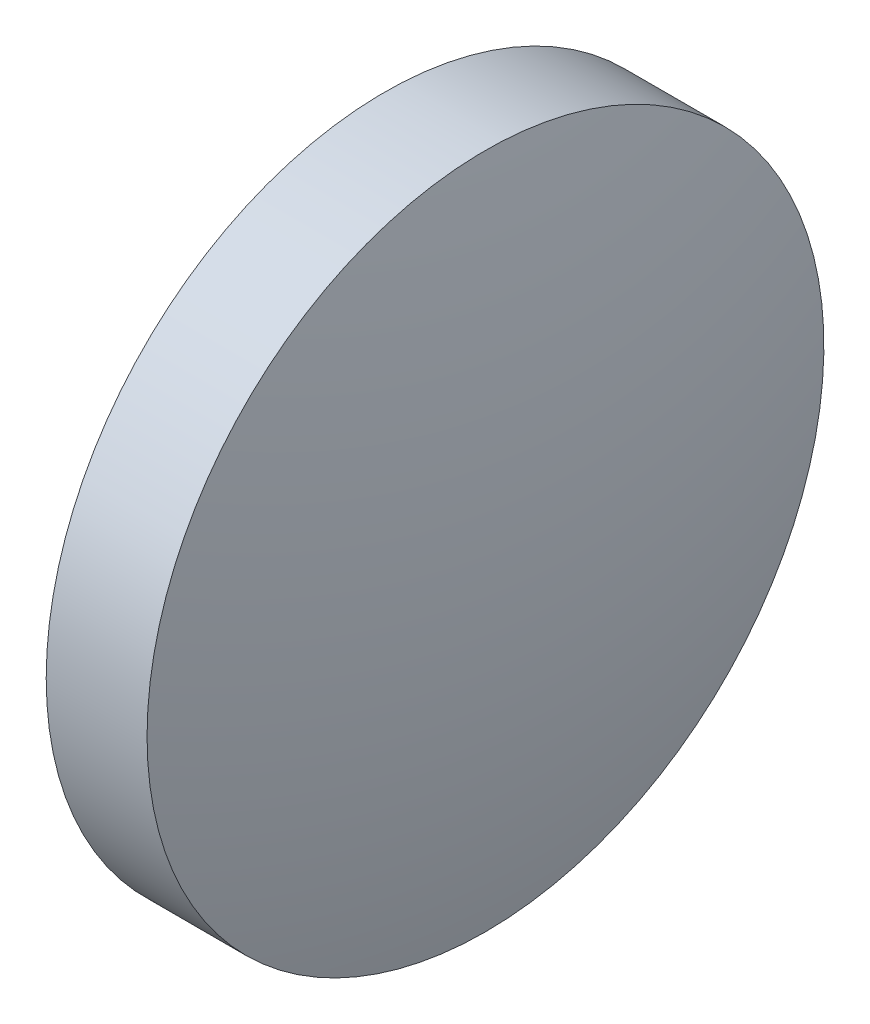
ISO-10303-21;
HEADER;
FILE_DESCRIPTION(('STEP AP214'),'2;1');
FILE_NAME('part.step','',(''),(''),'','','');
FILE_SCHEMA(('AUTOMOTIVE_DESIGN { 1 0 10303 214 1 1 1 1 }'));
ENDSEC;
DATA;
#1=APPLICATION_CONTEXT('core data for automotive mechanical design processes');
#2=APPLICATION_PROTOCOL_DEFINITION('international standard','automotive_design',2000,#1);
#3=PRODUCT_CONTEXT('',#1,'mechanical');
#4=PRODUCT('Part','Part','',(#3));
#5=PRODUCT_RELATED_PRODUCT_CATEGORY('part','',(#4));
#6=PRODUCT_DEFINITION_FORMATION('','',#4);
#7=PRODUCT_DEFINITION_CONTEXT('part definition',#1,'design');
#8=PRODUCT_DEFINITION('design','',#6,#7);
#9=PRODUCT_DEFINITION_SHAPE('','',#8);
#10=(LENGTH_UNIT() NAMED_UNIT(*) SI_UNIT(.MILLI.,.METRE.));
#11=(NAMED_UNIT(*) PLANE_ANGLE_UNIT() SI_UNIT($,.RADIAN.));
#12=(NAMED_UNIT(*) SI_UNIT($,.STERADIAN.) SOLID_ANGLE_UNIT());
#13=UNCERTAINTY_MEASURE_WITH_UNIT(LENGTH_MEASURE(1.E-05),#10,'distance_accuracy_value','');
#14=(GEOMETRIC_REPRESENTATION_CONTEXT(3) GLOBAL_UNCERTAINTY_ASSIGNED_CONTEXT((#13)) GLOBAL_UNIT_ASSIGNED_CONTEXT((#10,
#11,#12)) REPRESENTATION_CONTEXT('',''));
#15=CARTESIAN_POINT('',(0.,0.,0.));
#16=DIRECTION('',(0.,0.,1.));
#17=DIRECTION('',(1.,0.,0.));
#18=AXIS2_PLACEMENT_3D('',#15,#16,#17);
#19=CARTESIAN_POINT('',(489.005507928021,24.7488903059164,0.));
#20=DIRECTION('',(-1.,0.,0.));
#21=DIRECTION('',(0.,-1.,0.));
#22=AXIS2_PLACEMENT_3D('',#19,#20,#21);
#23=SPHERICAL_SURFACE('',#22,19.9675815035199);
#24=CARTESIAN_POINT('',(508.336941167688,24.7488903059163,0.));
#25=DIRECTION('',(-1.,0.,0.));
#26=DIRECTION('',(0.,0.,1.));
#27=AXIS2_PLACEMENT_3D('',#24,#25,#26);
#28=CIRCLE('',#27,5.);
#29=CARTESIAN_POINT('',(508.336941167688,24.7488903059163,5.));
#30=VERTEX_POINT('',#29);
#31=EDGE_CURVE('E10',#30,#30,#28,.T.);
#32=ORIENTED_EDGE('',*,*,#31,.F.);
#33=EDGE_LOOP('',(#32));
#34=FACE_BOUND('',#33,.T.);
#35=ADVANCED_FACE('F33',(#34),#23,.T.);
#36=CARTESIAN_POINT('',(505.905390695913,24.7488903059163,0.));
#37=DIRECTION('',(-1.,0.,0.));
#38=DIRECTION('',(0.,0.,1.));
#39=AXIS2_PLACEMENT_3D('',#36,#37,#38);
#40=CYLINDRICAL_SURFACE('',#39,5.);
#41=CARTESIAN_POINT('',(506.846941167688,24.7488903059163,0.));
#42=DIRECTION('',(-1.,0.,0.));
#43=DIRECTION('',(0.,0.,1.));
#44=AXIS2_PLACEMENT_3D('',#41,#42,#43);
#45=CIRCLE('',#44,5.);
#46=CARTESIAN_POINT('',(506.846941167688,24.7488903059163,5.));
#47=VERTEX_POINT('',#46);
#48=EDGE_CURVE('E39',#47,#47,#45,.T.);
#49=ORIENTED_EDGE('',*,*,#48,.F.);
#50=EDGE_LOOP('',(#49));
#51=FACE_BOUND('',#50,.T.);
#52=ORIENTED_EDGE('',*,*,#31,.T.);
#53=EDGE_LOOP('',(#52));
#54=FACE_BOUND('',#53,.T.);
#55=ADVANCED_FACE('F47',(#51,#54),#40,.T.);
#56=CARTESIAN_POINT('',(506.846941167688,24.7488903059163,0.));
#57=DIRECTION('',(1.,0.,0.));
#58=DIRECTION('',(0.,0.,-1.));
#59=AXIS2_PLACEMENT_3D('',#56,#57,#58);
#60=PLANE('',#59);
#61=ORIENTED_EDGE('',*,*,#48,.T.);
#62=EDGE_LOOP('',(#61));
#63=FACE_BOUND('',#62,.T.);
#64=ADVANCED_FACE('F45',(#63),#60,.F.);
#65=CLOSED_SHELL('',(#35,#55,#64));
#66=MANIFOLD_SOLID_BREP('B2',#65);
#67=ADVANCED_BREP_SHAPE_REPRESENTATION('',(#18,#66),#14);
#68=SHAPE_DEFINITION_REPRESENTATION(#9,#67);
ENDSEC;
END-ISO-10303-21;
